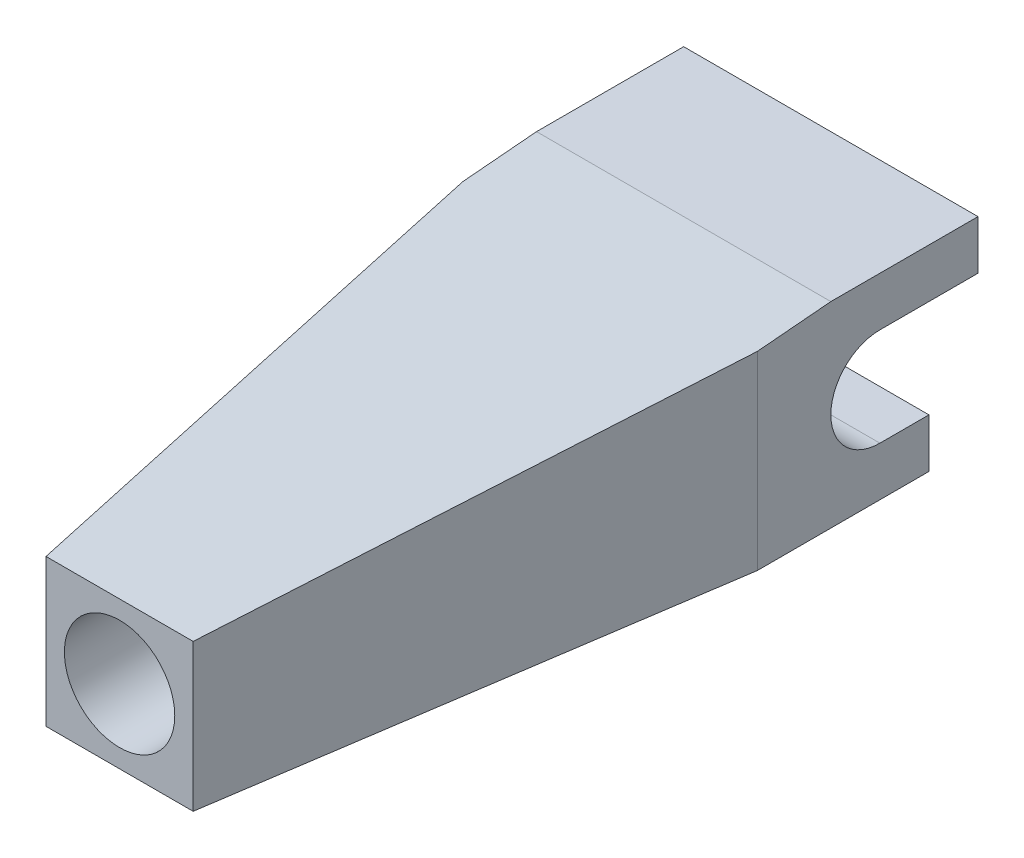
ISO-10303-21;
HEADER;
FILE_DESCRIPTION(('STEP AP214'),'2;1');
FILE_NAME('part.step','',(''),(''),'','','');
FILE_SCHEMA(('AUTOMOTIVE_DESIGN { 1 0 10303 214 1 1 1 1 }'));
ENDSEC;
DATA;
#1=APPLICATION_CONTEXT('core data for automotive mechanical design processes');
#2=APPLICATION_PROTOCOL_DEFINITION('international standard','automotive_design',2000,#1);
#3=PRODUCT_CONTEXT('',#1,'mechanical');
#4=PRODUCT('Part','Part','',(#3));
#5=PRODUCT_RELATED_PRODUCT_CATEGORY('part','',(#4));
#6=PRODUCT_DEFINITION_FORMATION('','',#4);
#7=PRODUCT_DEFINITION_CONTEXT('part definition',#1,'design');
#8=PRODUCT_DEFINITION('design','',#6,#7);
#9=PRODUCT_DEFINITION_SHAPE('','',#8);
#10=(LENGTH_UNIT() NAMED_UNIT(*) SI_UNIT(.MILLI.,.METRE.));
#11=(NAMED_UNIT(*) PLANE_ANGLE_UNIT() SI_UNIT($,.RADIAN.));
#12=(NAMED_UNIT(*) SI_UNIT($,.STERADIAN.) SOLID_ANGLE_UNIT());
#13=UNCERTAINTY_MEASURE_WITH_UNIT(LENGTH_MEASURE(1.E-05),#10,'distance_accuracy_value','');
#14=(GEOMETRIC_REPRESENTATION_CONTEXT(3) GLOBAL_UNCERTAINTY_ASSIGNED_CONTEXT((#13)) GLOBAL_UNIT_ASSIGNED_CONTEXT((#10,
#11,#12)) REPRESENTATION_CONTEXT('',''));
#15=CARTESIAN_POINT('',(0.,0.,0.));
#16=DIRECTION('',(0.,0.,1.));
#17=DIRECTION('',(1.,0.,0.));
#18=AXIS2_PLACEMENT_3D('',#15,#16,#17);
#19=CARTESIAN_POINT('',(12.,2.,0.));
#20=DIRECTION('',(0.,-0.996240588195683,-0.086629616364842));
#21=DIRECTION('',(0.,0.086629616364842,-0.996240588195683));
#22=AXIS2_PLACEMENT_3D('',#19,#20,#21);
#23=PLANE('',#22);
#24=DIRECTION('',(-1.,0.,0.));
#25=VECTOR('',#24,1.);
#26=CARTESIAN_POINT('',(12.,2.,0.));
#27=LINE('',#26,#25);
#28=CARTESIAN_POINT('',(9.,2.,0.));
#29=VERTEX_POINT('',#28);
#30=CARTESIAN_POINT('',(3.,2.,0.));
#31=VERTEX_POINT('',#30);
#32=EDGE_CURVE('E11',#29,#31,#27,.T.);
#33=ORIENTED_EDGE('',*,*,#32,.F.);
#34=DIRECTION('',(0.147794984007798,0.0856782515987234,-0.985299893385319));
#35=VECTOR('',#34,1.);
#36=CARTESIAN_POINT('',(9.0655300718936,2.03798844747454,-0.436867145957304));
#37=LINE('',#36,#35);
#38=CARTESIAN_POINT('',(12.,3.73913043478261,-20.));
#39=VERTEX_POINT('',#38);
#40=EDGE_CURVE('E118',#29,#39,#37,.T.);
#41=ORIENTED_EDGE('',*,*,#40,.T.);
#42=DIRECTION('',(0.,-0.086629616364842,0.996240588195683));
#43=VECTOR('',#42,1.);
#44=CARTESIAN_POINT('',(12.,2.,0.));
#45=LINE('',#44,#43);
#46=CARTESIAN_POINT('',(12.,4.,-23.));
#47=VERTEX_POINT('',#46);
#48=EDGE_CURVE('E161',#47,#39,#45,.T.);
#49=ORIENTED_EDGE('',*,*,#48,.F.);
#50=DIRECTION('',(-1.,0.,0.));
#51=VECTOR('',#50,1.);
#52=CARTESIAN_POINT('',(12.,4.,-23.));
#53=LINE('',#52,#51);
#54=CARTESIAN_POINT('',(0.,4.,-23.));
#55=VERTEX_POINT('',#54);
#56=EDGE_CURVE('E155',#47,#55,#53,.T.);
#57=ORIENTED_EDGE('',*,*,#56,.T.);
#58=DIRECTION('',(0.,-0.086629616364842,0.996240588195683));
#59=VECTOR('',#58,1.);
#60=CARTESIAN_POINT('',(0.,2.,0.));
#61=LINE('',#60,#59);
#62=CARTESIAN_POINT('',(0.,3.73913043478261,-20.));
#63=VERTEX_POINT('',#62);
#64=EDGE_CURVE('E174',#55,#63,#61,.T.);
#65=ORIENTED_EDGE('',*,*,#64,.T.);
#66=DIRECTION('',(0.147794984007798,-0.0856782515987234,0.985299893385319));
#67=VECTOR('',#66,1.);
#68=CARTESIAN_POINT('',(3.19659021568078,1.88603465757635,1.31060143787191));
#69=LINE('',#68,#67);
#70=EDGE_CURVE('E57',#63,#31,#69,.T.);
#71=ORIENTED_EDGE('',*,*,#70,.T.);
#72=EDGE_LOOP('',(#33,#41,#49,#57,#65,#71));
#73=FACE_BOUND('',#72,.T.);
#74=ADVANCED_FACE('F35',(#73),#23,.F.);
#75=CARTESIAN_POINT('',(12.,2.,0.));
#76=DIRECTION('',(0.,0.,-1.));
#77=DIRECTION('',(0.,1.,0.));
#78=AXIS2_PLACEMENT_3D('',#75,#76,#77);
#79=PLANE('',#78);
#80=CARTESIAN_POINT('',(6.,-1.,0.));
#81=DIRECTION('',(0.,0.,1.));
#82=DIRECTION('',(1.,0.,0.));
#83=AXIS2_PLACEMENT_3D('',#80,#81,#82);
#84=CIRCLE('',#83,2.25);
#85=CARTESIAN_POINT('',(8.25,-1.,0.));
#86=VERTEX_POINT('',#85);
#87=EDGE_CURVE('E199',#86,#86,#84,.T.);
#88=ORIENTED_EDGE('',*,*,#87,.F.);
#89=EDGE_LOOP('',(#88));
#90=FACE_BOUND('',#89,.T.);
#91=DIRECTION('',(-1.,0.,0.));
#92=VECTOR('',#91,1.);
#93=CARTESIAN_POINT('',(12.,-4.,0.));
#94=LINE('',#93,#92);
#95=CARTESIAN_POINT('',(9.,-4.,0.));
#96=VERTEX_POINT('',#95);
#97=CARTESIAN_POINT('',(3.,-4.,0.));
#98=VERTEX_POINT('',#97);
#99=EDGE_CURVE('E42',#96,#98,#94,.T.);
#100=ORIENTED_EDGE('',*,*,#99,.F.);
#101=DIRECTION('',(0.,1.,0.));
#102=VECTOR('',#101,1.);
#103=CARTESIAN_POINT('',(9.,-4.,0.));
#104=LINE('',#103,#102);
#105=EDGE_CURVE('E115',#96,#29,#104,.T.);
#106=ORIENTED_EDGE('',*,*,#105,.T.);
#107=ORIENTED_EDGE('',*,*,#32,.T.);
#108=DIRECTION('',(0.,1.,0.));
#109=VECTOR('',#108,1.);
#110=CARTESIAN_POINT('',(3.,-4.,0.));
#111=LINE('',#110,#109);
#112=EDGE_CURVE('E135',#98,#31,#111,.T.);
#113=ORIENTED_EDGE('',*,*,#112,.F.);
#114=EDGE_LOOP('',(#100,#106,#107,#113));
#115=FACE_BOUND('',#114,.T.);
#116=ADVANCED_FACE('F134',(#90,#115),#79,.F.);
#117=CARTESIAN_POINT('',(12.,-4.,-27.));
#118=DIRECTION('',(0.,1.,0.));
#119=DIRECTION('',(0.,0.,1.));
#120=AXIS2_PLACEMENT_3D('',#117,#118,#119);
#121=PLANE('',#120);
#122=DIRECTION('',(0.,0.,-1.));
#123=VECTOR('',#122,1.);
#124=CARTESIAN_POINT('',(12.,-4.,-27.));
#125=LINE('',#124,#123);
#126=CARTESIAN_POINT('',(12.,-4.,-20.));
#127=VERTEX_POINT('',#126);
#128=CARTESIAN_POINT('',(12.,-4.,-27.));
#129=VERTEX_POINT('',#128);
#130=EDGE_CURVE('E130',#127,#129,#125,.T.);
#131=ORIENTED_EDGE('',*,*,#130,.F.);
#132=DIRECTION('',(-0.148340452930245,0.,0.988936352868298));
#133=VECTOR('',#132,1.);
#134=CARTESIAN_POINT('',(12.,-4.,-20.));
#135=LINE('',#134,#133);
#136=EDGE_CURVE('E49',#127,#96,#135,.T.);
#137=ORIENTED_EDGE('',*,*,#136,.T.);
#138=ORIENTED_EDGE('',*,*,#99,.T.);
#139=DIRECTION('',(-0.148340452930245,0.,-0.988936352868298));
#140=VECTOR('',#139,1.);
#141=CARTESIAN_POINT('',(0.,-4.,-20.));
#142=LINE('',#141,#140);
#143=CARTESIAN_POINT('',(0.,-4.,-20.));
#144=VERTEX_POINT('',#143);
#145=EDGE_CURVE('E194',#98,#144,#142,.T.);
#146=ORIENTED_EDGE('',*,*,#145,.T.);
#147=DIRECTION('',(0.,0.,-1.));
#148=VECTOR('',#147,1.);
#149=CARTESIAN_POINT('',(0.,-4.,-27.));
#150=LINE('',#149,#148);
#151=CARTESIAN_POINT('',(0.,-4.,-27.));
#152=VERTEX_POINT('',#151);
#153=EDGE_CURVE('E172',#144,#152,#150,.T.);
#154=ORIENTED_EDGE('',*,*,#153,.T.);
#155=DIRECTION('',(-1.,0.,0.));
#156=VECTOR('',#155,1.);
#157=CARTESIAN_POINT('',(12.,-4.,-27.));
#158=LINE('',#157,#156);
#159=EDGE_CURVE('E136',#129,#152,#158,.T.);
#160=ORIENTED_EDGE('',*,*,#159,.F.);
#161=EDGE_LOOP('',(#131,#137,#138,#146,#154,#160));
#162=FACE_BOUND('',#161,.T.);
#163=ADVANCED_FACE('F126',(#162),#121,.F.);
#164=CARTESIAN_POINT('',(12.,-2.,-27.));
#165=DIRECTION('',(0.,0.,1.));
#166=DIRECTION('',(1.,0.,0.));
#167=AXIS2_PLACEMENT_3D('',#164,#165,#166);
#168=PLANE('',#167);
#169=DIRECTION('',(0.,1.,0.));
#170=VECTOR('',#169,1.);
#171=CARTESIAN_POINT('',(0.,-2.,-27.));
#172=LINE('',#171,#170);
#173=CARTESIAN_POINT('',(0.,-2.,-27.));
#174=VERTEX_POINT('',#173);
#175=EDGE_CURVE('E170',#152,#174,#172,.T.);
#176=ORIENTED_EDGE('',*,*,#175,.T.);
#177=DIRECTION('',(-1.,0.,0.));
#178=VECTOR('',#177,1.);
#179=CARTESIAN_POINT('',(12.,-2.,-27.));
#180=LINE('',#179,#178);
#181=CARTESIAN_POINT('',(12.,-2.,-27.));
#182=VERTEX_POINT('',#181);
#183=EDGE_CURVE('E138',#182,#174,#180,.T.);
#184=ORIENTED_EDGE('',*,*,#183,.F.);
#185=DIRECTION('',(0.,1.,0.));
#186=VECTOR('',#185,1.);
#187=CARTESIAN_POINT('',(12.,-2.,-27.));
#188=LINE('',#187,#186);
#189=EDGE_CURVE('E186',#129,#182,#188,.T.);
#190=ORIENTED_EDGE('',*,*,#189,.F.);
#191=ORIENTED_EDGE('',*,*,#159,.T.);
#192=EDGE_LOOP('',(#176,#184,#190,#191));
#193=FACE_BOUND('',#192,.T.);
#194=ADVANCED_FACE('F218',(#193),#168,.F.);
#195=CARTESIAN_POINT('',(12.,-2.,-25.));
#196=DIRECTION('',(0.,-1.,0.));
#197=DIRECTION('',(0.,0.,-1.));
#198=AXIS2_PLACEMENT_3D('',#195,#196,#197);
#199=PLANE('',#198);
#200=DIRECTION('',(0.,0.,1.));
#201=VECTOR('',#200,1.);
#202=CARTESIAN_POINT('',(0.,-2.,-25.));
#203=LINE('',#202,#201);
#204=CARTESIAN_POINT('',(0.,-2.,-25.));
#205=VERTEX_POINT('',#204);
#206=EDGE_CURVE('E168',#174,#205,#203,.T.);
#207=ORIENTED_EDGE('',*,*,#206,.T.);
#208=DIRECTION('',(-1.,0.,0.));
#209=VECTOR('',#208,1.);
#210=CARTESIAN_POINT('',(12.,-2.,-25.));
#211=LINE('',#210,#209);
#212=CARTESIAN_POINT('',(12.,-2.,-25.));
#213=VERTEX_POINT('',#212);
#214=EDGE_CURVE('E143',#213,#205,#211,.T.);
#215=ORIENTED_EDGE('',*,*,#214,.F.);
#216=DIRECTION('',(0.,0.,1.));
#217=VECTOR('',#216,1.);
#218=CARTESIAN_POINT('',(12.,-2.,-25.));
#219=LINE('',#218,#217);
#220=EDGE_CURVE('E184',#182,#213,#219,.T.);
#221=ORIENTED_EDGE('',*,*,#220,.F.);
#222=ORIENTED_EDGE('',*,*,#183,.T.);
#223=EDGE_LOOP('',(#207,#215,#221,#222));
#224=FACE_BOUND('',#223,.T.);
#225=ADVANCED_FACE('F224',(#224),#199,.F.);
#226=CARTESIAN_POINT('',(12.,0.,-25.));
#227=DIRECTION('',(-1.,0.,0.));
#228=DIRECTION('',(0.,0.,1.));
#229=AXIS2_PLACEMENT_3D('',#226,#227,#228);
#230=CYLINDRICAL_SURFACE('',#229,2.);
#231=CARTESIAN_POINT('',(0.,0.,-25.));
#232=DIRECTION('',(-1.,0.,0.));
#233=DIRECTION('',(0.,0.,-1.));
#234=AXIS2_PLACEMENT_3D('',#231,#232,#233);
#235=CIRCLE('',#234,2.);
#236=CARTESIAN_POINT('',(0.,2.,-25.));
#237=VERTEX_POINT('',#236);
#238=EDGE_CURVE('E166',#205,#237,#235,.T.);
#239=ORIENTED_EDGE('',*,*,#238,.T.);
#240=DIRECTION('',(-1.,0.,0.));
#241=VECTOR('',#240,1.);
#242=CARTESIAN_POINT('',(12.,2.,-25.));
#243=LINE('',#242,#241);
#244=CARTESIAN_POINT('',(12.,2.,-25.));
#245=VERTEX_POINT('',#244);
#246=EDGE_CURVE('E146',#245,#237,#243,.T.);
#247=ORIENTED_EDGE('',*,*,#246,.F.);
#248=CARTESIAN_POINT('',(12.,0.,-25.));
#249=DIRECTION('',(-1.,0.,0.));
#250=DIRECTION('',(0.,0.,-1.));
#251=AXIS2_PLACEMENT_3D('',#248,#249,#250);
#252=CIRCLE('',#251,2.);
#253=EDGE_CURVE('E182',#213,#245,#252,.T.);
#254=ORIENTED_EDGE('',*,*,#253,.F.);
#255=ORIENTED_EDGE('',*,*,#214,.T.);
#256=EDGE_LOOP('',(#239,#247,#254,#255));
#257=FACE_BOUND('',#256,.T.);
#258=ADVANCED_FACE('F228',(#257),#230,.F.);
#259=CARTESIAN_POINT('',(12.,2.,-25.));
#260=DIRECTION('',(0.,1.,0.));
#261=DIRECTION('',(0.,0.,1.));
#262=AXIS2_PLACEMENT_3D('',#259,#260,#261);
#263=PLANE('',#262);
#264=DIRECTION('',(0.,0.,-1.));
#265=VECTOR('',#264,1.);
#266=CARTESIAN_POINT('',(0.,2.,-25.));
#267=LINE('',#266,#265);
#268=CARTESIAN_POINT('',(0.,2.,-29.));
#269=VERTEX_POINT('',#268);
#270=EDGE_CURVE('E164',#237,#269,#267,.T.);
#271=ORIENTED_EDGE('',*,*,#270,.T.);
#272=DIRECTION('',(-1.,0.,0.));
#273=VECTOR('',#272,1.);
#274=CARTESIAN_POINT('',(12.,2.,-29.));
#275=LINE('',#274,#273);
#276=CARTESIAN_POINT('',(12.,2.,-29.));
#277=VERTEX_POINT('',#276);
#278=EDGE_CURVE('E149',#277,#269,#275,.T.);
#279=ORIENTED_EDGE('',*,*,#278,.F.);
#280=DIRECTION('',(0.,0.,-1.));
#281=VECTOR('',#280,1.);
#282=CARTESIAN_POINT('',(12.,2.,-25.));
#283=LINE('',#282,#281);
#284=EDGE_CURVE('E180',#245,#277,#283,.T.);
#285=ORIENTED_EDGE('',*,*,#284,.F.);
#286=ORIENTED_EDGE('',*,*,#246,.T.);
#287=EDGE_LOOP('',(#271,#279,#285,#286));
#288=FACE_BOUND('',#287,.T.);
#289=ADVANCED_FACE('F232',(#288),#263,.F.);
#290=CARTESIAN_POINT('',(12.,4.,-29.));
#291=DIRECTION('',(0.,0.,1.));
#292=DIRECTION('',(1.,0.,0.));
#293=AXIS2_PLACEMENT_3D('',#290,#291,#292);
#294=PLANE('',#293);
#295=DIRECTION('',(0.,1.,0.));
#296=VECTOR('',#295,1.);
#297=CARTESIAN_POINT('',(0.,4.,-29.));
#298=LINE('',#297,#296);
#299=CARTESIAN_POINT('',(0.,4.,-29.));
#300=VERTEX_POINT('',#299);
#301=EDGE_CURVE('E162',#269,#300,#298,.T.);
#302=ORIENTED_EDGE('',*,*,#301,.T.);
#303=DIRECTION('',(-1.,0.,0.));
#304=VECTOR('',#303,1.);
#305=CARTESIAN_POINT('',(12.,4.,-29.));
#306=LINE('',#305,#304);
#307=CARTESIAN_POINT('',(12.,4.,-29.));
#308=VERTEX_POINT('',#307);
#309=EDGE_CURVE('E152',#308,#300,#306,.T.);
#310=ORIENTED_EDGE('',*,*,#309,.F.);
#311=DIRECTION('',(0.,1.,0.));
#312=VECTOR('',#311,1.);
#313=CARTESIAN_POINT('',(12.,4.,-29.));
#314=LINE('',#313,#312);
#315=EDGE_CURVE('E178',#277,#308,#314,.T.);
#316=ORIENTED_EDGE('',*,*,#315,.F.);
#317=ORIENTED_EDGE('',*,*,#278,.T.);
#318=EDGE_LOOP('',(#302,#310,#316,#317));
#319=FACE_BOUND('',#318,.T.);
#320=ADVANCED_FACE('F236',(#319),#294,.F.);
#321=CARTESIAN_POINT('',(12.,4.,-23.));
#322=DIRECTION('',(0.,-1.,0.));
#323=DIRECTION('',(0.,0.,-1.));
#324=AXIS2_PLACEMENT_3D('',#321,#322,#323);
#325=PLANE('',#324);
#326=DIRECTION('',(0.,0.,1.));
#327=VECTOR('',#326,1.);
#328=CARTESIAN_POINT('',(0.,4.,-23.));
#329=LINE('',#328,#327);
#330=EDGE_CURVE('E159',#300,#55,#329,.T.);
#331=ORIENTED_EDGE('',*,*,#330,.T.);
#332=ORIENTED_EDGE('',*,*,#56,.F.);
#333=DIRECTION('',(0.,0.,1.));
#334=VECTOR('',#333,1.);
#335=CARTESIAN_POINT('',(12.,4.,-23.));
#336=LINE('',#335,#334);
#337=EDGE_CURVE('E158',#308,#47,#336,.T.);
#338=ORIENTED_EDGE('',*,*,#337,.F.);
#339=ORIENTED_EDGE('',*,*,#309,.T.);
#340=EDGE_LOOP('',(#331,#332,#338,#339));
#341=FACE_BOUND('',#340,.T.);
#342=ADVANCED_FACE('F240',(#341),#325,.F.);
#343=CARTESIAN_POINT('',(12.,0.,-25.));
#344=DIRECTION('',(1.,0.,0.));
#345=DIRECTION('',(0.,0.,-1.));
#346=AXIS2_PLACEMENT_3D('',#343,#344,#345);
#347=PLANE('',#346);
#348=DIRECTION('',(0.,1.,0.));
#349=VECTOR('',#348,1.);
#350=CARTESIAN_POINT('',(12.,-4.,-20.));
#351=LINE('',#350,#349);
#352=EDGE_CURVE('E122',#127,#39,#351,.T.);
#353=ORIENTED_EDGE('',*,*,#352,.F.);
#354=ORIENTED_EDGE('',*,*,#130,.T.);
#355=ORIENTED_EDGE('',*,*,#189,.T.);
#356=ORIENTED_EDGE('',*,*,#220,.T.);
#357=ORIENTED_EDGE('',*,*,#253,.T.);
#358=ORIENTED_EDGE('',*,*,#284,.T.);
#359=ORIENTED_EDGE('',*,*,#315,.T.);
#360=ORIENTED_EDGE('',*,*,#337,.T.);
#361=ORIENTED_EDGE('',*,*,#48,.T.);
#362=EDGE_LOOP('',(#353,#354,#355,#356,#357,#358,#359,#360,#361));
#363=FACE_BOUND('',#362,.T.);
#364=ADVANCED_FACE('F244',(#363),#347,.T.);
#365=CARTESIAN_POINT('',(0.,0.,-25.));
#366=DIRECTION('',(1.,0.,0.));
#367=DIRECTION('',(0.,0.,-1.));
#368=AXIS2_PLACEMENT_3D('',#365,#366,#367);
#369=PLANE('',#368);
#370=ORIENTED_EDGE('',*,*,#153,.F.);
#371=DIRECTION('',(0.,1.,0.));
#372=VECTOR('',#371,1.);
#373=CARTESIAN_POINT('',(0.,-4.,-20.));
#374=LINE('',#373,#372);
#375=EDGE_CURVE('E192',#144,#63,#374,.T.);
#376=ORIENTED_EDGE('',*,*,#375,.T.);
#377=ORIENTED_EDGE('',*,*,#64,.F.);
#378=ORIENTED_EDGE('',*,*,#330,.F.);
#379=ORIENTED_EDGE('',*,*,#301,.F.);
#380=ORIENTED_EDGE('',*,*,#270,.F.);
#381=ORIENTED_EDGE('',*,*,#238,.F.);
#382=ORIENTED_EDGE('',*,*,#206,.F.);
#383=ORIENTED_EDGE('',*,*,#175,.F.);
#384=EDGE_LOOP('',(#370,#376,#377,#378,#379,#380,#381,#382,#383));
#385=FACE_BOUND('',#384,.T.);
#386=ADVANCED_FACE('F246',(#385),#369,.F.);
#387=CARTESIAN_POINT('',(0.,-4.,-20.));
#388=DIRECTION('',(0.988936352868298,0.,-0.148340452930245));
#389=DIRECTION('',(-0.148340452930245,0.,-0.988936352868298));
#390=AXIS2_PLACEMENT_3D('',#387,#388,#389);
#391=PLANE('',#390);
#392=ORIENTED_EDGE('',*,*,#375,.F.);
#393=ORIENTED_EDGE('',*,*,#145,.F.);
#394=ORIENTED_EDGE('',*,*,#112,.T.);
#395=ORIENTED_EDGE('',*,*,#70,.F.);
#396=EDGE_LOOP('',(#392,#393,#394,#395));
#397=FACE_BOUND('',#396,.T.);
#398=ADVANCED_FACE('F249',(#397),#391,.F.);
#399=CARTESIAN_POINT('',(12.,-4.,-20.));
#400=DIRECTION('',(-0.988936352868298,0.,-0.148340452930245));
#401=DIRECTION('',(-0.148340452930245,0.,0.988936352868298));
#402=AXIS2_PLACEMENT_3D('',#399,#400,#401);
#403=PLANE('',#402);
#404=ORIENTED_EDGE('',*,*,#105,.F.);
#405=ORIENTED_EDGE('',*,*,#136,.F.);
#406=ORIENTED_EDGE('',*,*,#352,.T.);
#407=ORIENTED_EDGE('',*,*,#40,.F.);
#408=EDGE_LOOP('',(#404,#405,#406,#407));
#409=FACE_BOUND('',#408,.T.);
#410=ADVANCED_FACE('F116',(#409),#403,.F.);
#411=CARTESIAN_POINT('',(6.,-1.,-20.));
#412=DIRECTION('',(0.,0.,1.));
#413=DIRECTION('',(1.,0.,0.));
#414=AXIS2_PLACEMENT_3D('',#411,#412,#413);
#415=CYLINDRICAL_SURFACE('',#414,2.25);
#416=CARTESIAN_POINT('',(6.,-1.,-20.));
#417=DIRECTION('',(0.,0.,1.));
#418=DIRECTION('',(1.,0.,0.));
#419=AXIS2_PLACEMENT_3D('',#416,#417,#418);
#420=CIRCLE('',#419,2.25);
#421=CARTESIAN_POINT('',(8.25,-1.,-20.));
#422=VERTEX_POINT('',#421);
#423=EDGE_CURVE('E131',#422,#422,#420,.T.);
#424=ORIENTED_EDGE('',*,*,#423,.F.);
#425=EDGE_LOOP('',(#424));
#426=FACE_BOUND('',#425,.T.);
#427=ORIENTED_EDGE('',*,*,#87,.T.);
#428=EDGE_LOOP('',(#427));
#429=FACE_BOUND('',#428,.T.);
#430=ADVANCED_FACE('F207',(#426,#429),#415,.F.);
#431=CARTESIAN_POINT('',(6.,-1.,-20.));
#432=DIRECTION('',(0.,0.,1.));
#433=DIRECTION('',(1.,0.,0.));
#434=AXIS2_PLACEMENT_3D('',#431,#432,#433);
#435=PLANE('',#434);
#436=ORIENTED_EDGE('',*,*,#423,.T.);
#437=EDGE_LOOP('',(#436));
#438=FACE_BOUND('',#437,.T.);
#439=ADVANCED_FACE('F205',(#438),#435,.T.);
#440=CLOSED_SHELL('',(#74,#116,#163,#194,#225,#258,#289,#320,#342,#364,#386,#398,#410,#430,#439));
#441=MANIFOLD_SOLID_BREP('B2',#440);
#442=ADVANCED_BREP_SHAPE_REPRESENTATION('',(#18,#441),#14);
#443=SHAPE_DEFINITION_REPRESENTATION(#9,#442);
ENDSEC;
END-ISO-10303-21;
